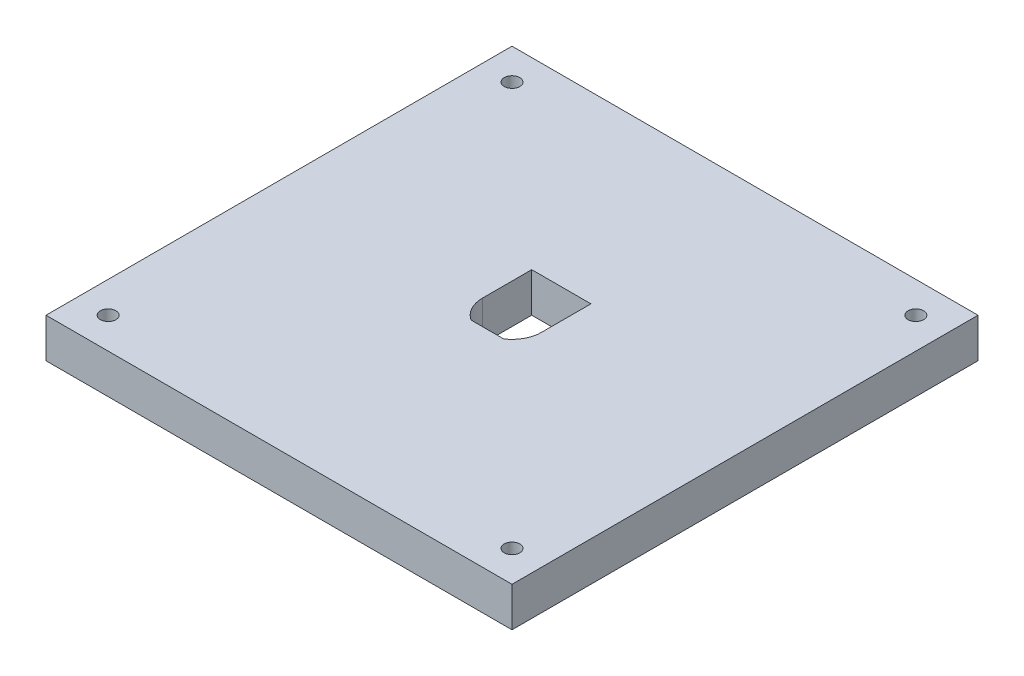
ISO-10303-21;
HEADER;
FILE_DESCRIPTION(('STEP AP214'),'2;1');
FILE_NAME('part.step','',(''),(''),'','','');
FILE_SCHEMA(('AUTOMOTIVE_DESIGN { 1 0 10303 214 1 1 1 1 }'));
ENDSEC;
DATA;
#1=APPLICATION_CONTEXT('core data for automotive mechanical design processes');
#2=APPLICATION_PROTOCOL_DEFINITION('international standard','automotive_design',2000,#1);
#3=PRODUCT_CONTEXT('',#1,'mechanical');
#4=PRODUCT('Part','Part','',(#3));
#5=PRODUCT_RELATED_PRODUCT_CATEGORY('part','',(#4));
#6=PRODUCT_DEFINITION_FORMATION('','',#4);
#7=PRODUCT_DEFINITION_CONTEXT('part definition',#1,'design');
#8=PRODUCT_DEFINITION('design','',#6,#7);
#9=PRODUCT_DEFINITION_SHAPE('','',#8);
#10=(LENGTH_UNIT() NAMED_UNIT(*) SI_UNIT(.MILLI.,.METRE.));
#11=(NAMED_UNIT(*) PLANE_ANGLE_UNIT() SI_UNIT($,.RADIAN.));
#12=(NAMED_UNIT(*) SI_UNIT($,.STERADIAN.) SOLID_ANGLE_UNIT());
#13=UNCERTAINTY_MEASURE_WITH_UNIT(LENGTH_MEASURE(1.E-05),#10,'distance_accuracy_value','');
#14=(GEOMETRIC_REPRESENTATION_CONTEXT(3) GLOBAL_UNCERTAINTY_ASSIGNED_CONTEXT((#13)) GLOBAL_UNIT_ASSIGNED_CONTEXT((#10,
#11,#12)) REPRESENTATION_CONTEXT('',''));
#15=CARTESIAN_POINT('',(0.,0.,0.));
#16=DIRECTION('',(0.,0.,1.));
#17=DIRECTION('',(1.,0.,0.));
#18=AXIS2_PLACEMENT_3D('',#15,#16,#17);
#19=CARTESIAN_POINT('',(0.,12.7,0.));
#20=DIRECTION('',(0.,-1.,0.));
#21=DIRECTION('',(0.,0.,-1.));
#22=AXIS2_PLACEMENT_3D('',#19,#20,#21);
#23=PLANE('',#22);
#24=CARTESIAN_POINT('',(140.,12.7,-10.));
#25=DIRECTION('',(0.,1.,0.));
#26=DIRECTION('',(0.,0.,1.));
#27=AXIS2_PLACEMENT_3D('',#24,#25,#26);
#28=CIRCLE('',#27,2.50000000000002);
#29=CARTESIAN_POINT('',(140.,12.7,-7.50000000000001));
#30=VERTEX_POINT('',#29);
#31=EDGE_CURVE('E318',#30,#30,#28,.T.);
#32=ORIENTED_EDGE('',*,*,#31,.F.);
#33=EDGE_LOOP('',(#32));
#34=FACE_BOUND('',#33,.T.);
#35=CARTESIAN_POINT('',(10.,12.7,-140.));
#36=DIRECTION('',(0.,1.,0.));
#37=DIRECTION('',(0.,0.,1.));
#38=AXIS2_PLACEMENT_3D('',#35,#36,#37);
#39=CIRCLE('',#38,2.5);
#40=CARTESIAN_POINT('',(10.,12.7,-137.5));
#41=VERTEX_POINT('',#40);
#42=EDGE_CURVE('E162',#41,#41,#39,.T.);
#43=ORIENTED_EDGE('',*,*,#42,.F.);
#44=EDGE_LOOP('',(#43));
#45=FACE_BOUND('',#44,.T.);
#46=DIRECTION('',(1.,0.,0.));
#47=VECTOR('',#46,1.);
#48=CARTESIAN_POINT('',(0.,12.7,-67.0625));
#49=LINE('',#48,#47);
#50=CARTESIAN_POINT('',(69.7348581453108,12.7,-67.0625));
#51=VERTEX_POINT('',#50);
#52=CARTESIAN_POINT('',(80.2651418546892,12.7,-67.0625));
#53=VERTEX_POINT('',#52);
#54=EDGE_CURVE('E161',#51,#53,#49,.T.);
#55=ORIENTED_EDGE('',*,*,#54,.F.);
#56=CARTESIAN_POINT('',(75.,12.7,-75.));
#57=DIRECTION('',(0.,1.,0.));
#58=DIRECTION('',(0.,0.,1.));
#59=AXIS2_PLACEMENT_3D('',#56,#57,#58);
#60=CIRCLE('',#59,9.52500000000001);
#61=CARTESIAN_POINT('',(65.475,12.7,-75.));
#62=VERTEX_POINT('',#61);
#63=EDGE_CURVE('E55',#62,#51,#60,.T.);
#64=ORIENTED_EDGE('',*,*,#63,.F.);
#65=DIRECTION('',(0.,0.,-1.));
#66=VECTOR('',#65,1.);
#67=CARTESIAN_POINT('',(65.4750000000001,12.7,0.));
#68=LINE('',#67,#66);
#69=CARTESIAN_POINT('',(65.475,12.7,-90.875));
#70=VERTEX_POINT('',#69);
#71=EDGE_CURVE('E138',#62,#70,#68,.T.);
#72=ORIENTED_EDGE('',*,*,#71,.T.);
#73=DIRECTION('',(-1.,0.,0.));
#74=VECTOR('',#73,1.);
#75=CARTESIAN_POINT('',(0.,12.7,-90.875));
#76=LINE('',#75,#74);
#77=CARTESIAN_POINT('',(84.525,12.7,-90.875));
#78=VERTEX_POINT('',#77);
#79=EDGE_CURVE('E142',#78,#70,#76,.T.);
#80=ORIENTED_EDGE('',*,*,#79,.F.);
#81=DIRECTION('',(0.,0.,-1.));
#82=VECTOR('',#81,1.);
#83=CARTESIAN_POINT('',(84.5250000000001,12.7,0.));
#84=LINE('',#83,#82);
#85=CARTESIAN_POINT('',(84.525,12.7,-75.));
#86=VERTEX_POINT('',#85);
#87=EDGE_CURVE('E169',#86,#78,#84,.T.);
#88=ORIENTED_EDGE('',*,*,#87,.F.);
#89=CARTESIAN_POINT('',(75.,12.7,-75.));
#90=DIRECTION('',(0.,1.,0.));
#91=DIRECTION('',(0.,0.,1.));
#92=AXIS2_PLACEMENT_3D('',#89,#90,#91);
#93=CIRCLE('',#92,9.52500000000001);
#94=EDGE_CURVE('E165',#53,#86,#93,.T.);
#95=ORIENTED_EDGE('',*,*,#94,.F.);
#96=EDGE_LOOP('',(#55,#64,#72,#80,#88,#95));
#97=FACE_BOUND('',#96,.T.);
#98=DIRECTION('',(0.,0.,1.));
#99=VECTOR('',#98,1.);
#100=CARTESIAN_POINT('',(0.,12.7,0.));
#101=LINE('',#100,#99);
#102=CARTESIAN_POINT('',(0.,12.7,-150.));
#103=VERTEX_POINT('',#102);
#104=CARTESIAN_POINT('',(0.,12.7,0.));
#105=VERTEX_POINT('',#104);
#106=EDGE_CURVE('E191',#103,#105,#101,.T.);
#107=ORIENTED_EDGE('',*,*,#106,.T.);
#108=DIRECTION('',(1.,0.,0.));
#109=VECTOR('',#108,1.);
#110=CARTESIAN_POINT('',(0.,12.7,0.));
#111=LINE('',#110,#109);
#112=CARTESIAN_POINT('',(150.,12.7,0.));
#113=VERTEX_POINT('',#112);
#114=EDGE_CURVE('E195',#105,#113,#111,.T.);
#115=ORIENTED_EDGE('',*,*,#114,.T.);
#116=DIRECTION('',(0.,0.,-1.));
#117=VECTOR('',#116,1.);
#118=CARTESIAN_POINT('',(150.,12.7,0.));
#119=LINE('',#118,#117);
#120=CARTESIAN_POINT('',(150.,12.7,-150.));
#121=VERTEX_POINT('',#120);
#122=EDGE_CURVE('E199',#113,#121,#119,.T.);
#123=ORIENTED_EDGE('',*,*,#122,.T.);
#124=DIRECTION('',(-1.,0.,0.));
#125=VECTOR('',#124,1.);
#126=CARTESIAN_POINT('',(0.,12.7,-150.));
#127=LINE('',#126,#125);
#128=EDGE_CURVE('E202',#121,#103,#127,.T.);
#129=ORIENTED_EDGE('',*,*,#128,.T.);
#130=EDGE_LOOP('',(#107,#115,#123,#129));
#131=FACE_BOUND('',#130,.T.);
#132=CARTESIAN_POINT('',(140.,12.7,-140.));
#133=DIRECTION('',(0.,-1.,0.));
#134=DIRECTION('',(0.,0.,-1.));
#135=AXIS2_PLACEMENT_3D('',#132,#133,#134);
#136=CIRCLE('',#135,2.50000000000002);
#137=CARTESIAN_POINT('',(140.,12.7,-142.5));
#138=VERTEX_POINT('',#137);
#139=EDGE_CURVE('E325',#138,#138,#136,.T.);
#140=ORIENTED_EDGE('',*,*,#139,.T.);
#141=EDGE_LOOP('',(#140));
#142=FACE_BOUND('',#141,.T.);
#143=CARTESIAN_POINT('',(10.,12.7,-10.));
#144=DIRECTION('',(0.,-1.,0.));
#145=DIRECTION('',(0.,0.,-1.));
#146=AXIS2_PLACEMENT_3D('',#143,#144,#145);
#147=CIRCLE('',#146,2.5);
#148=CARTESIAN_POINT('',(10.,12.7,-12.5));
#149=VERTEX_POINT('',#148);
#150=EDGE_CURVE('E327',#149,#149,#147,.T.);
#151=ORIENTED_EDGE('',*,*,#150,.T.);
#152=EDGE_LOOP('',(#151));
#153=FACE_BOUND('',#152,.T.);
#154=ADVANCED_FACE('F39',(#34,#45,#97,#131,#142,#153),#23,.F.);
#155=CARTESIAN_POINT('',(0.,0.,0.));
#156=DIRECTION('',(0.,-1.,0.));
#157=DIRECTION('',(0.,0.,-1.));
#158=AXIS2_PLACEMENT_3D('',#155,#156,#157);
#159=PLANE('',#158);
#160=CARTESIAN_POINT('',(140.,0.,-140.));
#161=DIRECTION('',(0.,-1.,0.));
#162=DIRECTION('',(0.,0.,-1.));
#163=AXIS2_PLACEMENT_3D('',#160,#161,#162);
#164=CIRCLE('',#163,2.50000000000002);
#165=CARTESIAN_POINT('',(140.,0.,-142.5));
#166=VERTEX_POINT('',#165);
#167=EDGE_CURVE('E320',#166,#166,#164,.T.);
#168=ORIENTED_EDGE('',*,*,#167,.F.);
#169=EDGE_LOOP('',(#168));
#170=FACE_BOUND('',#169,.T.);
#171=CARTESIAN_POINT('',(10.,0.,-140.));
#172=DIRECTION('',(0.,1.,0.));
#173=DIRECTION('',(0.,0.,1.));
#174=AXIS2_PLACEMENT_3D('',#171,#172,#173);
#175=CIRCLE('',#174,2.5);
#176=CARTESIAN_POINT('',(10.,0.,-137.5));
#177=VERTEX_POINT('',#176);
#178=EDGE_CURVE('E342',#177,#177,#175,.T.);
#179=ORIENTED_EDGE('',*,*,#178,.T.);
#180=EDGE_LOOP('',(#179));
#181=FACE_BOUND('',#180,.T.);
#182=CARTESIAN_POINT('',(75.,0.,-75.));
#183=DIRECTION('',(0.,1.,0.));
#184=DIRECTION('',(0.,0.,1.));
#185=AXIS2_PLACEMENT_3D('',#182,#183,#184);
#186=CIRCLE('',#185,9.52500000000001);
#187=CARTESIAN_POINT('',(65.475,0.,-75.));
#188=VERTEX_POINT('',#187);
#189=CARTESIAN_POINT('',(69.7348581453108,0.,-67.0625));
#190=VERTEX_POINT('',#189);
#191=EDGE_CURVE('E119',#188,#190,#186,.T.);
#192=ORIENTED_EDGE('',*,*,#191,.T.);
#193=DIRECTION('',(1.,0.,0.));
#194=VECTOR('',#193,1.);
#195=CARTESIAN_POINT('',(0.,0.,-67.0625));
#196=LINE('',#195,#194);
#197=CARTESIAN_POINT('',(80.2651418546892,0.,-67.0625));
#198=VERTEX_POINT('',#197);
#199=EDGE_CURVE('E129',#190,#198,#196,.T.);
#200=ORIENTED_EDGE('',*,*,#199,.T.);
#201=CARTESIAN_POINT('',(75.,0.,-75.));
#202=DIRECTION('',(0.,1.,0.));
#203=DIRECTION('',(0.,0.,1.));
#204=AXIS2_PLACEMENT_3D('',#201,#202,#203);
#205=CIRCLE('',#204,9.52500000000001);
#206=CARTESIAN_POINT('',(84.525,0.,-75.));
#207=VERTEX_POINT('',#206);
#208=EDGE_CURVE('E63',#198,#207,#205,.T.);
#209=ORIENTED_EDGE('',*,*,#208,.T.);
#210=DIRECTION('',(0.,0.,-1.));
#211=VECTOR('',#210,1.);
#212=CARTESIAN_POINT('',(84.5250000000001,0.,0.));
#213=LINE('',#212,#211);
#214=CARTESIAN_POINT('',(84.525,0.,-90.875));
#215=VERTEX_POINT('',#214);
#216=EDGE_CURVE('E150',#207,#215,#213,.T.);
#217=ORIENTED_EDGE('',*,*,#216,.T.);
#218=DIRECTION('',(-1.,0.,0.));
#219=VECTOR('',#218,1.);
#220=CARTESIAN_POINT('',(0.,0.,-90.875));
#221=LINE('',#220,#219);
#222=CARTESIAN_POINT('',(65.475,0.,-90.875));
#223=VERTEX_POINT('',#222);
#224=EDGE_CURVE('E154',#215,#223,#221,.T.);
#225=ORIENTED_EDGE('',*,*,#224,.T.);
#226=DIRECTION('',(0.,0.,-1.));
#227=VECTOR('',#226,1.);
#228=CARTESIAN_POINT('',(65.4750000000001,0.,0.));
#229=LINE('',#228,#227);
#230=EDGE_CURVE('E126',#188,#223,#229,.T.);
#231=ORIENTED_EDGE('',*,*,#230,.F.);
#232=EDGE_LOOP('',(#192,#200,#209,#217,#225,#231));
#233=FACE_BOUND('',#232,.T.);
#234=DIRECTION('',(0.,0.,1.));
#235=VECTOR('',#234,1.);
#236=CARTESIAN_POINT('',(0.,0.,0.));
#237=LINE('',#236,#235);
#238=CARTESIAN_POINT('',(0.,0.,-150.));
#239=VERTEX_POINT('',#238);
#240=CARTESIAN_POINT('',(0.,0.,0.));
#241=VERTEX_POINT('',#240);
#242=EDGE_CURVE('E179',#239,#241,#237,.T.);
#243=ORIENTED_EDGE('',*,*,#242,.F.);
#244=DIRECTION('',(-1.,0.,0.));
#245=VECTOR('',#244,1.);
#246=CARTESIAN_POINT('',(0.,0.,-150.));
#247=LINE('',#246,#245);
#248=CARTESIAN_POINT('',(150.,0.,-150.));
#249=VERTEX_POINT('',#248);
#250=EDGE_CURVE('E196',#249,#239,#247,.T.);
#251=ORIENTED_EDGE('',*,*,#250,.F.);
#252=DIRECTION('',(0.,0.,-1.));
#253=VECTOR('',#252,1.);
#254=CARTESIAN_POINT('',(150.,0.,0.));
#255=LINE('',#254,#253);
#256=CARTESIAN_POINT('',(150.,0.,0.));
#257=VERTEX_POINT('',#256);
#258=EDGE_CURVE('E212',#257,#249,#255,.T.);
#259=ORIENTED_EDGE('',*,*,#258,.F.);
#260=DIRECTION('',(1.,0.,0.));
#261=VECTOR('',#260,1.);
#262=CARTESIAN_POINT('',(0.,0.,0.));
#263=LINE('',#262,#261);
#264=EDGE_CURVE('E209',#241,#257,#263,.T.);
#265=ORIENTED_EDGE('',*,*,#264,.F.);
#266=EDGE_LOOP('',(#243,#251,#259,#265));
#267=FACE_BOUND('',#266,.T.);
#268=CARTESIAN_POINT('',(140.,0.,-10.));
#269=DIRECTION('',(0.,1.,0.));
#270=DIRECTION('',(0.,0.,1.));
#271=AXIS2_PLACEMENT_3D('',#268,#269,#270);
#272=CIRCLE('',#271,2.50000000000002);
#273=CARTESIAN_POINT('',(140.,0.,-7.50000000000001));
#274=VERTEX_POINT('',#273);
#275=EDGE_CURVE('E316',#274,#274,#272,.T.);
#276=ORIENTED_EDGE('',*,*,#275,.T.);
#277=EDGE_LOOP('',(#276));
#278=FACE_BOUND('',#277,.T.);
#279=CARTESIAN_POINT('',(10.,0.,-10.));
#280=DIRECTION('',(0.,-1.,0.));
#281=DIRECTION('',(0.,0.,-1.));
#282=AXIS2_PLACEMENT_3D('',#279,#280,#281);
#283=CIRCLE('',#282,2.5);
#284=CARTESIAN_POINT('',(10.,0.,-12.5));
#285=VERTEX_POINT('',#284);
#286=EDGE_CURVE('E145',#285,#285,#283,.T.);
#287=ORIENTED_EDGE('',*,*,#286,.F.);
#288=EDGE_LOOP('',(#287));
#289=FACE_BOUND('',#288,.T.);
#290=ADVANCED_FACE('F134',(#170,#181,#233,#267,#278,#289),#159,.T.);
#291=CARTESIAN_POINT('',(0.,12.7,0.));
#292=DIRECTION('',(1.,0.,0.));
#293=DIRECTION('',(0.,0.,-1.));
#294=AXIS2_PLACEMENT_3D('',#291,#292,#293);
#295=PLANE('',#294);
#296=ORIENTED_EDGE('',*,*,#242,.T.);
#297=DIRECTION('',(0.,-1.,0.));
#298=VECTOR('',#297,1.);
#299=CARTESIAN_POINT('',(0.,12.7,0.));
#300=LINE('',#299,#298);
#301=EDGE_CURVE('E11',#105,#241,#300,.T.);
#302=ORIENTED_EDGE('',*,*,#301,.F.);
#303=ORIENTED_EDGE('',*,*,#106,.F.);
#304=DIRECTION('',(0.,-1.,0.));
#305=VECTOR('',#304,1.);
#306=CARTESIAN_POINT('',(0.,12.7,-150.));
#307=LINE('',#306,#305);
#308=EDGE_CURVE('E205',#103,#239,#307,.T.);
#309=ORIENTED_EDGE('',*,*,#308,.T.);
#310=EDGE_LOOP('',(#296,#302,#303,#309));
#311=FACE_BOUND('',#310,.T.);
#312=ADVANCED_FACE('F41',(#311),#295,.F.);
#313=CARTESIAN_POINT('',(0.,12.7,0.));
#314=DIRECTION('',(0.,0.,-1.));
#315=DIRECTION('',(-1.,0.,0.));
#316=AXIS2_PLACEMENT_3D('',#313,#314,#315);
#317=PLANE('',#316);
#318=ORIENTED_EDGE('',*,*,#264,.T.);
#319=DIRECTION('',(0.,-1.,0.));
#320=VECTOR('',#319,1.);
#321=CARTESIAN_POINT('',(150.,12.7,0.));
#322=LINE('',#321,#320);
#323=EDGE_CURVE('E48',#113,#257,#322,.T.);
#324=ORIENTED_EDGE('',*,*,#323,.F.);
#325=ORIENTED_EDGE('',*,*,#114,.F.);
#326=ORIENTED_EDGE('',*,*,#301,.T.);
#327=EDGE_LOOP('',(#318,#324,#325,#326));
#328=FACE_BOUND('',#327,.T.);
#329=ADVANCED_FACE('F244',(#328),#317,.F.);
#330=CARTESIAN_POINT('',(150.,12.7,0.));
#331=DIRECTION('',(-1.,0.,0.));
#332=DIRECTION('',(0.,0.,1.));
#333=AXIS2_PLACEMENT_3D('',#330,#331,#332);
#334=PLANE('',#333);
#335=ORIENTED_EDGE('',*,*,#258,.T.);
#336=DIRECTION('',(0.,-1.,0.));
#337=VECTOR('',#336,1.);
#338=CARTESIAN_POINT('',(150.,12.7,-150.));
#339=LINE('',#338,#337);
#340=EDGE_CURVE('E220',#121,#249,#339,.T.);
#341=ORIENTED_EDGE('',*,*,#340,.F.);
#342=ORIENTED_EDGE('',*,*,#122,.F.);
#343=ORIENTED_EDGE('',*,*,#323,.T.);
#344=EDGE_LOOP('',(#335,#341,#342,#343));
#345=FACE_BOUND('',#344,.T.);
#346=ADVANCED_FACE('F229',(#345),#334,.F.);
#347=CARTESIAN_POINT('',(0.,12.7,-150.));
#348=DIRECTION('',(0.,0.,1.));
#349=DIRECTION('',(1.,0.,0.));
#350=AXIS2_PLACEMENT_3D('',#347,#348,#349);
#351=PLANE('',#350);
#352=ORIENTED_EDGE('',*,*,#250,.T.);
#353=ORIENTED_EDGE('',*,*,#308,.F.);
#354=ORIENTED_EDGE('',*,*,#128,.F.);
#355=ORIENTED_EDGE('',*,*,#340,.T.);
#356=EDGE_LOOP('',(#352,#353,#354,#355));
#357=FACE_BOUND('',#356,.T.);
#358=ADVANCED_FACE('F237',(#357),#351,.F.);
#359=CARTESIAN_POINT('',(75.,0.,-75.));
#360=DIRECTION('',(0.,1.,0.));
#361=DIRECTION('',(0.,0.,1.));
#362=AXIS2_PLACEMENT_3D('',#359,#360,#361);
#363=CYLINDRICAL_SURFACE('',#362,9.52500000000001);
#364=ORIENTED_EDGE('',*,*,#63,.T.);
#365=DIRECTION('',(0.,1.,0.));
#366=VECTOR('',#365,1.);
#367=CARTESIAN_POINT('',(69.7348581453108,0.,-67.0625));
#368=LINE('',#367,#366);
#369=EDGE_CURVE('E115',#190,#51,#368,.T.);
#370=ORIENTED_EDGE('',*,*,#369,.F.);
#371=ORIENTED_EDGE('',*,*,#191,.F.);
#372=DIRECTION('',(0.,1.,0.));
#373=VECTOR('',#372,1.);
#374=CARTESIAN_POINT('',(65.475,0.,-75.));
#375=LINE('',#374,#373);
#376=EDGE_CURVE('E176',#188,#62,#375,.T.);
#377=ORIENTED_EDGE('',*,*,#376,.T.);
#378=EDGE_LOOP('',(#364,#370,#371,#377));
#379=FACE_BOUND('',#378,.T.);
#380=ADVANCED_FACE('F117',(#379),#363,.F.);
#381=CARTESIAN_POINT('',(65.4750000000001,0.,0.));
#382=DIRECTION('',(1.,0.,0.));
#383=DIRECTION('',(0.,0.,-1.));
#384=AXIS2_PLACEMENT_3D('',#381,#382,#383);
#385=PLANE('',#384);
#386=ORIENTED_EDGE('',*,*,#71,.F.);
#387=ORIENTED_EDGE('',*,*,#376,.F.);
#388=ORIENTED_EDGE('',*,*,#230,.T.);
#389=DIRECTION('',(0.,1.,0.));
#390=VECTOR('',#389,1.);
#391=CARTESIAN_POINT('',(65.475,0.,-90.875));
#392=LINE('',#391,#390);
#393=EDGE_CURVE('E180',#223,#70,#392,.T.);
#394=ORIENTED_EDGE('',*,*,#393,.T.);
#395=EDGE_LOOP('',(#386,#387,#388,#394));
#396=FACE_BOUND('',#395,.T.);
#397=ADVANCED_FACE('F268',(#396),#385,.T.);
#398=CARTESIAN_POINT('',(0.,0.,-90.875));
#399=DIRECTION('',(0.,0.,-1.));
#400=DIRECTION('',(-1.,0.,0.));
#401=AXIS2_PLACEMENT_3D('',#398,#399,#400);
#402=PLANE('',#401);
#403=ORIENTED_EDGE('',*,*,#79,.T.);
#404=ORIENTED_EDGE('',*,*,#393,.F.);
#405=ORIENTED_EDGE('',*,*,#224,.F.);
#406=DIRECTION('',(0.,1.,0.));
#407=VECTOR('',#406,1.);
#408=CARTESIAN_POINT('',(84.525,0.,-90.875));
#409=LINE('',#408,#407);
#410=EDGE_CURVE('E183',#215,#78,#409,.T.);
#411=ORIENTED_EDGE('',*,*,#410,.T.);
#412=EDGE_LOOP('',(#403,#404,#405,#411));
#413=FACE_BOUND('',#412,.T.);
#414=ADVANCED_FACE('F272',(#413),#402,.F.);
#415=CARTESIAN_POINT('',(84.5250000000001,0.,0.));
#416=DIRECTION('',(1.,0.,0.));
#417=DIRECTION('',(0.,0.,-1.));
#418=AXIS2_PLACEMENT_3D('',#415,#416,#417);
#419=PLANE('',#418);
#420=ORIENTED_EDGE('',*,*,#87,.T.);
#421=ORIENTED_EDGE('',*,*,#410,.F.);
#422=ORIENTED_EDGE('',*,*,#216,.F.);
#423=DIRECTION('',(0.,1.,0.));
#424=VECTOR('',#423,1.);
#425=CARTESIAN_POINT('',(84.525,0.,-75.));
#426=LINE('',#425,#424);
#427=EDGE_CURVE('E186',#207,#86,#426,.T.);
#428=ORIENTED_EDGE('',*,*,#427,.T.);
#429=EDGE_LOOP('',(#420,#421,#422,#428));
#430=FACE_BOUND('',#429,.T.);
#431=ADVANCED_FACE('F278',(#430),#419,.F.);
#432=CARTESIAN_POINT('',(75.,0.,-75.));
#433=DIRECTION('',(0.,1.,0.));
#434=DIRECTION('',(0.,0.,1.));
#435=AXIS2_PLACEMENT_3D('',#432,#433,#434);
#436=CYLINDRICAL_SURFACE('',#435,9.52500000000001);
#437=ORIENTED_EDGE('',*,*,#94,.T.);
#438=ORIENTED_EDGE('',*,*,#427,.F.);
#439=ORIENTED_EDGE('',*,*,#208,.F.);
#440=DIRECTION('',(0.,1.,0.));
#441=VECTOR('',#440,1.);
#442=CARTESIAN_POINT('',(80.2651418546892,0.,-67.0625));
#443=LINE('',#442,#441);
#444=EDGE_CURVE('E125',#198,#53,#443,.T.);
#445=ORIENTED_EDGE('',*,*,#444,.T.);
#446=EDGE_LOOP('',(#437,#438,#439,#445));
#447=FACE_BOUND('',#446,.T.);
#448=ADVANCED_FACE('F288',(#447),#436,.F.);
#449=CARTESIAN_POINT('',(0.,0.,-67.0625));
#450=DIRECTION('',(0.,0.,1.));
#451=DIRECTION('',(1.,0.,0.));
#452=AXIS2_PLACEMENT_3D('',#449,#450,#451);
#453=PLANE('',#452);
#454=ORIENTED_EDGE('',*,*,#54,.T.);
#455=ORIENTED_EDGE('',*,*,#444,.F.);
#456=ORIENTED_EDGE('',*,*,#199,.F.);
#457=ORIENTED_EDGE('',*,*,#369,.T.);
#458=EDGE_LOOP('',(#454,#455,#456,#457));
#459=FACE_BOUND('',#458,.T.);
#460=ADVANCED_FACE('F130',(#459),#453,.F.);
#461=CARTESIAN_POINT('',(10.,0.,-140.));
#462=DIRECTION('',(0.,1.,0.));
#463=DIRECTION('',(0.,0.,1.));
#464=AXIS2_PLACEMENT_3D('',#461,#462,#463);
#465=CYLINDRICAL_SURFACE('',#464,2.5);
#466=ORIENTED_EDGE('',*,*,#178,.F.);
#467=EDGE_LOOP('',(#466));
#468=FACE_BOUND('',#467,.T.);
#469=ORIENTED_EDGE('',*,*,#42,.T.);
#470=EDGE_LOOP('',(#469));
#471=FACE_BOUND('',#470,.T.);
#472=ADVANCED_FACE('F292',(#468,#471),#465,.F.);
#473=CARTESIAN_POINT('',(140.,0.,-140.));
#474=DIRECTION('',(0.,1.,0.));
#475=DIRECTION('',(0.,0.,1.));
#476=AXIS2_PLACEMENT_3D('',#473,#474,#475);
#477=CYLINDRICAL_SURFACE('',#476,2.50000000000002);
#478=ORIENTED_EDGE('',*,*,#167,.T.);
#479=EDGE_LOOP('',(#478));
#480=FACE_BOUND('',#479,.T.);
#481=ORIENTED_EDGE('',*,*,#139,.F.);
#482=EDGE_LOOP('',(#481));
#483=FACE_BOUND('',#482,.T.);
#484=ADVANCED_FACE('F296',(#480,#483),#477,.F.);
#485=CARTESIAN_POINT('',(140.,0.,-10.));
#486=DIRECTION('',(0.,1.,0.));
#487=DIRECTION('',(0.,0.,1.));
#488=AXIS2_PLACEMENT_3D('',#485,#486,#487);
#489=CYLINDRICAL_SURFACE('',#488,2.50000000000002);
#490=ORIENTED_EDGE('',*,*,#275,.F.);
#491=EDGE_LOOP('',(#490));
#492=FACE_BOUND('',#491,.T.);
#493=ORIENTED_EDGE('',*,*,#31,.T.);
#494=EDGE_LOOP('',(#493));
#495=FACE_BOUND('',#494,.T.);
#496=ADVANCED_FACE('F302',(#492,#495),#489,.F.);
#497=CARTESIAN_POINT('',(10.,0.,-10.));
#498=DIRECTION('',(0.,1.,0.));
#499=DIRECTION('',(0.,0.,1.));
#500=AXIS2_PLACEMENT_3D('',#497,#498,#499);
#501=CYLINDRICAL_SURFACE('',#500,2.5);
#502=ORIENTED_EDGE('',*,*,#286,.T.);
#503=EDGE_LOOP('',(#502));
#504=FACE_BOUND('',#503,.T.);
#505=ORIENTED_EDGE('',*,*,#150,.F.);
#506=EDGE_LOOP('',(#505));
#507=FACE_BOUND('',#506,.T.);
#508=ADVANCED_FACE('F283',(#504,#507),#501,.F.);
#509=CLOSED_SHELL('',(#154,#290,#312,#329,#346,#358,#380,#397,#414,#431,#448,#460,#472,#484,
#496,#508));
#510=MANIFOLD_SOLID_BREP('B2',#509);
#511=ADVANCED_BREP_SHAPE_REPRESENTATION('',(#18,#510),#14);
#512=SHAPE_DEFINITION_REPRESENTATION(#9,#511);
ENDSEC;
END-ISO-10303-21;
